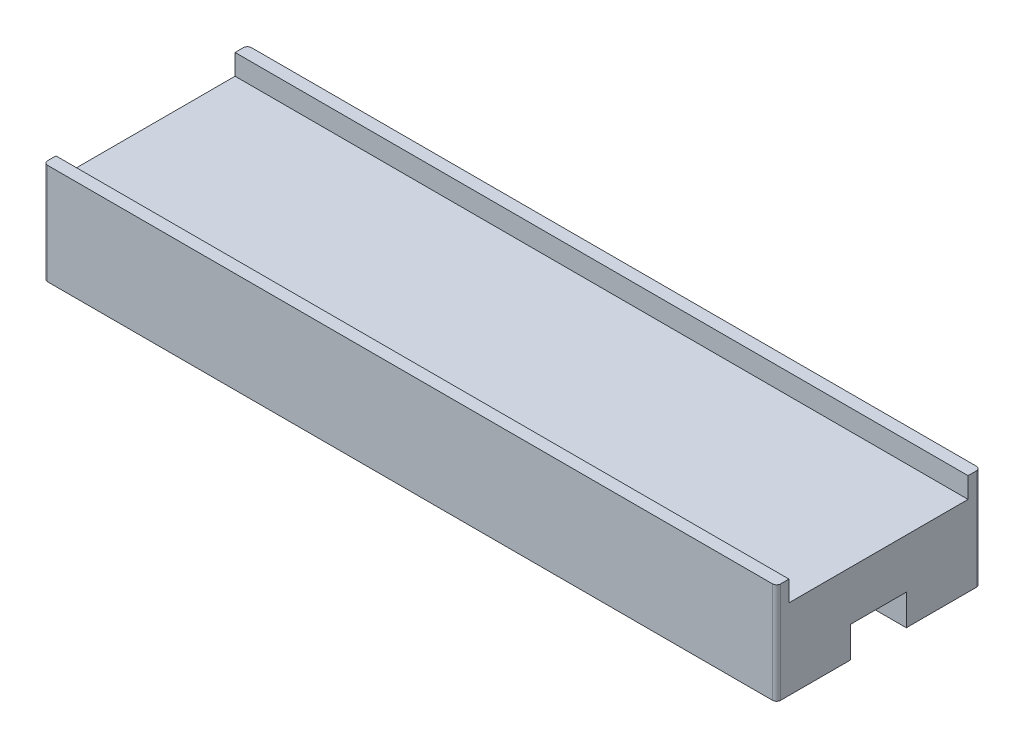
ISO-10303-21;
HEADER;
FILE_DESCRIPTION(('STEP AP214'),'2;1');
FILE_NAME('part.step','',(''),(''),'','','');
FILE_SCHEMA(('AUTOMOTIVE_DESIGN { 1 0 10303 214 1 1 1 1 }'));
ENDSEC;
DATA;
#1=APPLICATION_CONTEXT('core data for automotive mechanical design processes');
#2=APPLICATION_PROTOCOL_DEFINITION('international standard','automotive_design',2000,#1);
#3=PRODUCT_CONTEXT('',#1,'mechanical');
#4=PRODUCT('Part','Part','',(#3));
#5=PRODUCT_RELATED_PRODUCT_CATEGORY('part','',(#4));
#6=PRODUCT_DEFINITION_FORMATION('','',#4);
#7=PRODUCT_DEFINITION_CONTEXT('part definition',#1,'design');
#8=PRODUCT_DEFINITION('design','',#6,#7);
#9=PRODUCT_DEFINITION_SHAPE('','',#8);
#10=(LENGTH_UNIT() NAMED_UNIT(*) SI_UNIT(.MILLI.,.METRE.));
#11=(NAMED_UNIT(*) PLANE_ANGLE_UNIT() SI_UNIT($,.RADIAN.));
#12=(NAMED_UNIT(*) SI_UNIT($,.STERADIAN.) SOLID_ANGLE_UNIT());
#13=UNCERTAINTY_MEASURE_WITH_UNIT(LENGTH_MEASURE(1.E-05),#10,'distance_accuracy_value','');
#14=(GEOMETRIC_REPRESENTATION_CONTEXT(3) GLOBAL_UNCERTAINTY_ASSIGNED_CONTEXT((#13)) GLOBAL_UNIT_ASSIGNED_CONTEXT((#10,
#11,#12)) REPRESENTATION_CONTEXT('',''));
#15=CARTESIAN_POINT('',(0.,0.,0.));
#16=DIRECTION('',(0.,0.,1.));
#17=DIRECTION('',(1.,0.,0.));
#18=AXIS2_PLACEMENT_3D('',#15,#16,#17);
#19=CARTESIAN_POINT('',(0.,3.9,0.));
#20=DIRECTION('',(0.,-1.,0.));
#21=DIRECTION('',(0.,0.,-1.));
#22=AXIS2_PLACEMENT_3D('',#19,#20,#21);
#23=PLANE('',#22);
#24=DIRECTION('',(1.,0.,0.));
#25=VECTOR('',#24,1.);
#26=CARTESIAN_POINT('',(0.,3.9,-9.3));
#27=LINE('',#26,#25);
#28=CARTESIAN_POINT('',(0.,3.9,-9.3));
#29=VERTEX_POINT('',#28);
#30=CARTESIAN_POINT('',(35.6,3.9,-9.3));
#31=VERTEX_POINT('',#30);
#32=EDGE_CURVE('E181',#29,#31,#27,.T.);
#33=ORIENTED_EDGE('',*,*,#32,.F.);
#34=DIRECTION('',(0.,0.,1.));
#35=VECTOR('',#34,1.);
#36=CARTESIAN_POINT('',(0.,3.9,0.));
#37=LINE('',#36,#35);
#38=CARTESIAN_POINT('',(0.,3.9,-0.6));
#39=VERTEX_POINT('',#38);
#40=EDGE_CURVE('E167',#29,#39,#37,.T.);
#41=ORIENTED_EDGE('',*,*,#40,.T.);
#42=DIRECTION('',(-1.,0.,0.));
#43=VECTOR('',#42,1.);
#44=CARTESIAN_POINT('',(0.,3.9,-0.6));
#45=LINE('',#44,#43);
#46=CARTESIAN_POINT('',(35.6,3.9,-0.6));
#47=VERTEX_POINT('',#46);
#48=EDGE_CURVE('E170',#47,#39,#45,.T.);
#49=ORIENTED_EDGE('',*,*,#48,.F.);
#50=DIRECTION('',(0.,0.,-1.));
#51=VECTOR('',#50,1.);
#52=CARTESIAN_POINT('',(35.6,3.9,0.));
#53=LINE('',#52,#51);
#54=EDGE_CURVE('E202',#47,#31,#53,.T.);
#55=ORIENTED_EDGE('',*,*,#54,.T.);
#56=EDGE_LOOP('',(#33,#41,#49,#55));
#57=FACE_BOUND('',#56,.T.);
#58=ADVANCED_FACE('F34',(#57),#23,.F.);
#59=CARTESIAN_POINT('',(0.,0.,0.));
#60=DIRECTION('',(0.,-1.,0.));
#61=DIRECTION('',(0.,0.,-1.));
#62=AXIS2_PLACEMENT_3D('',#59,#60,#61);
#63=PLANE('',#62);
#64=DIRECTION('',(1.,0.,0.));
#65=VECTOR('',#64,1.);
#66=CARTESIAN_POINT('',(0.,0.,0.));
#67=LINE('',#66,#65);
#68=CARTESIAN_POINT('',(0.2,0.,0.));
#69=VERTEX_POINT('',#68);
#70=CARTESIAN_POINT('',(35.4,0.,0.));
#71=VERTEX_POINT('',#70);
#72=EDGE_CURVE('E227',#69,#71,#67,.T.);
#73=ORIENTED_EDGE('',*,*,#72,.F.);
#74=CARTESIAN_POINT('',(0.2,0.,-0.2));
#75=DIRECTION('',(0.,-1.,0.));
#76=DIRECTION('',(0.,0.,-1.));
#77=AXIS2_PLACEMENT_3D('',#74,#75,#76);
#78=CIRCLE('',#77,0.2);
#79=CARTESIAN_POINT('',(0.,0.,-0.2));
#80=VERTEX_POINT('',#79);
#81=EDGE_CURVE('E260',#69,#80,#78,.T.);
#82=ORIENTED_EDGE('',*,*,#81,.T.);
#83=DIRECTION('',(0.,0.,1.));
#84=VECTOR('',#83,1.);
#85=CARTESIAN_POINT('',(0.,0.,0.));
#86=LINE('',#85,#84);
#87=CARTESIAN_POINT('',(0.,0.,-3.6));
#88=VERTEX_POINT('',#87);
#89=EDGE_CURVE('E228',#88,#80,#86,.T.);
#90=ORIENTED_EDGE('',*,*,#89,.F.);
#91=DIRECTION('',(1.,0.,0.));
#92=VECTOR('',#91,1.);
#93=CARTESIAN_POINT('',(0.,0.,-3.6));
#94=LINE('',#93,#92);
#95=CARTESIAN_POINT('',(35.6,0.,-3.6));
#96=VERTEX_POINT('',#95);
#97=EDGE_CURVE('E221',#88,#96,#94,.T.);
#98=ORIENTED_EDGE('',*,*,#97,.T.);
#99=DIRECTION('',(0.,0.,-1.));
#100=VECTOR('',#99,1.);
#101=CARTESIAN_POINT('',(35.6,0.,0.));
#102=LINE('',#101,#100);
#103=CARTESIAN_POINT('',(35.6,0.,-0.2));
#104=VERTEX_POINT('',#103);
#105=EDGE_CURVE('E232',#104,#96,#102,.T.);
#106=ORIENTED_EDGE('',*,*,#105,.F.);
#107=CARTESIAN_POINT('',(35.4,0.,-0.2));
#108=DIRECTION('',(0.,-1.,0.));
#109=DIRECTION('',(0.,0.,-1.));
#110=AXIS2_PLACEMENT_3D('',#107,#108,#109);
#111=CIRCLE('',#110,0.2);
#112=EDGE_CURVE('E57',#104,#71,#111,.T.);
#113=ORIENTED_EDGE('',*,*,#112,.T.);
#114=EDGE_LOOP('',(#73,#82,#90,#98,#106,#113));
#115=FACE_BOUND('',#114,.T.);
#116=ADVANCED_FACE('F274',(#115),#63,.T.);
#117=CARTESIAN_POINT('',(0.,3.9,0.));
#118=DIRECTION('',(1.,0.,0.));
#119=DIRECTION('',(0.,0.,-1.));
#120=AXIS2_PLACEMENT_3D('',#117,#118,#119);
#121=PLANE('',#120);
#122=DIRECTION('',(0.,0.,1.));
#123=VECTOR('',#122,1.);
#124=CARTESIAN_POINT('',(0.,4.9,-9.9));
#125=LINE('',#124,#123);
#126=CARTESIAN_POINT('',(0.,4.9,-9.7));
#127=VERTEX_POINT('',#126);
#128=CARTESIAN_POINT('',(0.,4.9,-9.3));
#129=VERTEX_POINT('',#128);
#130=EDGE_CURVE('E147',#127,#129,#125,.T.);
#131=ORIENTED_EDGE('',*,*,#130,.F.);
#132=DIRECTION('',(0.,-1.,0.));
#133=VECTOR('',#132,1.);
#134=CARTESIAN_POINT('',(0.,3.9,-9.7));
#135=LINE('',#134,#133);
#136=CARTESIAN_POINT('',(0.,0.,-9.7));
#137=VERTEX_POINT('',#136);
#138=EDGE_CURVE('E314',#127,#137,#135,.T.);
#139=ORIENTED_EDGE('',*,*,#138,.T.);
#140=CARTESIAN_POINT('',(0.,0.,-6.3));
#141=VERTEX_POINT('',#140);
#142=EDGE_CURVE('E225',#137,#141,#86,.T.);
#143=ORIENTED_EDGE('',*,*,#142,.T.);
#144=DIRECTION('',(0.,1.,0.));
#145=VECTOR('',#144,1.);
#146=CARTESIAN_POINT('',(0.,0.,-6.3));
#147=LINE('',#146,#145);
#148=CARTESIAN_POINT('',(0.,1.5,-6.3));
#149=VERTEX_POINT('',#148);
#150=EDGE_CURVE('E284',#141,#149,#147,.T.);
#151=ORIENTED_EDGE('',*,*,#150,.T.);
#152=DIRECTION('',(0.,0.,1.));
#153=VECTOR('',#152,1.);
#154=CARTESIAN_POINT('',(0.,1.5,-3.6));
#155=LINE('',#154,#153);
#156=CARTESIAN_POINT('',(0.,1.5,-3.6));
#157=VERTEX_POINT('',#156);
#158=EDGE_CURVE('E281',#149,#157,#155,.T.);
#159=ORIENTED_EDGE('',*,*,#158,.T.);
#160=DIRECTION('',(0.,-1.,0.));
#161=VECTOR('',#160,1.);
#162=CARTESIAN_POINT('',(0.,0.,-3.6));
#163=LINE('',#162,#161);
#164=EDGE_CURVE('E196',#157,#88,#163,.T.);
#165=ORIENTED_EDGE('',*,*,#164,.T.);
#166=ORIENTED_EDGE('',*,*,#89,.T.);
#167=DIRECTION('',(0.,-1.,0.));
#168=VECTOR('',#167,1.);
#169=CARTESIAN_POINT('',(0.,3.9,-0.2));
#170=LINE('',#169,#168);
#171=CARTESIAN_POINT('',(0.,4.9,-0.2));
#172=VERTEX_POINT('',#171);
#173=EDGE_CURVE('E217',#80,#172,#170,.F.);
#174=ORIENTED_EDGE('',*,*,#173,.T.);
#175=DIRECTION('',(0.,0.,1.));
#176=VECTOR('',#175,1.);
#177=CARTESIAN_POINT('',(0.,4.9,0.));
#178=LINE('',#177,#176);
#179=CARTESIAN_POINT('',(0.,4.9,-0.6));
#180=VERTEX_POINT('',#179);
#181=EDGE_CURVE('E184',#180,#172,#178,.T.);
#182=ORIENTED_EDGE('',*,*,#181,.F.);
#183=DIRECTION('',(0.,-1.,0.));
#184=VECTOR('',#183,1.);
#185=CARTESIAN_POINT('',(0.,4.9,-0.6));
#186=LINE('',#185,#184);
#187=EDGE_CURVE('E193',#180,#39,#186,.T.);
#188=ORIENTED_EDGE('',*,*,#187,.T.);
#189=ORIENTED_EDGE('',*,*,#40,.F.);
#190=DIRECTION('',(0.,-1.,0.));
#191=VECTOR('',#190,1.);
#192=CARTESIAN_POINT('',(0.,4.9,-9.3));
#193=LINE('',#192,#191);
#194=EDGE_CURVE('E164',#129,#29,#193,.T.);
#195=ORIENTED_EDGE('',*,*,#194,.F.);
#196=EDGE_LOOP('',(#131,#139,#143,#151,#159,#165,#166,#174,#182,#188,#189,#195));
#197=FACE_BOUND('',#196,.T.);
#198=ADVANCED_FACE('F165',(#197),#121,.F.);
#199=CARTESIAN_POINT('',(0.,3.9,0.));
#200=DIRECTION('',(0.,0.,-1.));
#201=DIRECTION('',(-1.,0.,0.));
#202=AXIS2_PLACEMENT_3D('',#199,#200,#201);
#203=PLANE('',#202);
#204=DIRECTION('',(1.,0.,0.));
#205=VECTOR('',#204,1.);
#206=CARTESIAN_POINT('',(0.,4.9,0.));
#207=LINE('',#206,#205);
#208=CARTESIAN_POINT('',(0.2,4.9,0.));
#209=VERTEX_POINT('',#208);
#210=CARTESIAN_POINT('',(35.4,4.9,0.));
#211=VERTEX_POINT('',#210);
#212=EDGE_CURVE('E187',#209,#211,#207,.T.);
#213=ORIENTED_EDGE('',*,*,#212,.F.);
#214=DIRECTION('',(0.,-1.,0.));
#215=VECTOR('',#214,1.);
#216=CARTESIAN_POINT('',(0.2,3.9,0.));
#217=LINE('',#216,#215);
#218=EDGE_CURVE('E256',#209,#69,#217,.T.);
#219=ORIENTED_EDGE('',*,*,#218,.T.);
#220=ORIENTED_EDGE('',*,*,#72,.T.);
#221=DIRECTION('',(0.,-1.,0.));
#222=VECTOR('',#221,1.);
#223=CARTESIAN_POINT('',(35.4,3.9,0.));
#224=LINE('',#223,#222);
#225=EDGE_CURVE('E254',#71,#211,#224,.F.);
#226=ORIENTED_EDGE('',*,*,#225,.T.);
#227=EDGE_LOOP('',(#213,#219,#220,#226));
#228=FACE_BOUND('',#227,.T.);
#229=ADVANCED_FACE('F371',(#228),#203,.F.);
#230=CARTESIAN_POINT('',(35.6,3.9,0.));
#231=DIRECTION('',(-1.,0.,0.));
#232=DIRECTION('',(0.,0.,1.));
#233=AXIS2_PLACEMENT_3D('',#230,#231,#232);
#234=PLANE('',#233);
#235=CARTESIAN_POINT('',(35.6,0.,-6.3));
#236=VERTEX_POINT('',#235);
#237=CARTESIAN_POINT('',(35.6,0.,-9.7));
#238=VERTEX_POINT('',#237);
#239=EDGE_CURVE('E231',#236,#238,#102,.T.);
#240=ORIENTED_EDGE('',*,*,#239,.T.);
#241=DIRECTION('',(0.,-1.,0.));
#242=VECTOR('',#241,1.);
#243=CARTESIAN_POINT('',(35.6,3.9,-9.7));
#244=LINE('',#243,#242);
#245=CARTESIAN_POINT('',(35.6,4.9,-9.7));
#246=VERTEX_POINT('',#245);
#247=EDGE_CURVE('E11',#238,#246,#244,.F.);
#248=ORIENTED_EDGE('',*,*,#247,.T.);
#249=DIRECTION('',(0.,0.,-1.));
#250=VECTOR('',#249,1.);
#251=CARTESIAN_POINT('',(35.6,4.9,-9.9));
#252=LINE('',#251,#250);
#253=CARTESIAN_POINT('',(35.6,4.9,-9.30000000000001));
#254=VERTEX_POINT('',#253);
#255=EDGE_CURVE('E176',#254,#246,#252,.T.);
#256=ORIENTED_EDGE('',*,*,#255,.F.);
#257=DIRECTION('',(0.,-1.,0.));
#258=VECTOR('',#257,1.);
#259=CARTESIAN_POINT('',(35.6,4.9,-9.30000000000001));
#260=LINE('',#259,#258);
#261=EDGE_CURVE('E171',#254,#31,#260,.T.);
#262=ORIENTED_EDGE('',*,*,#261,.T.);
#263=ORIENTED_EDGE('',*,*,#54,.F.);
#264=DIRECTION('',(0.,-1.,0.));
#265=VECTOR('',#264,1.);
#266=CARTESIAN_POINT('',(35.6,4.9,-0.6));
#267=LINE('',#266,#265);
#268=CARTESIAN_POINT('',(35.6,4.9,-0.6));
#269=VERTEX_POINT('',#268);
#270=EDGE_CURVE('E206',#269,#47,#267,.T.);
#271=ORIENTED_EDGE('',*,*,#270,.F.);
#272=DIRECTION('',(0.,0.,-1.));
#273=VECTOR('',#272,1.);
#274=CARTESIAN_POINT('',(35.6,4.9,0.));
#275=LINE('',#274,#273);
#276=CARTESIAN_POINT('',(35.6,4.9,-0.2));
#277=VERTEX_POINT('',#276);
#278=EDGE_CURVE('E189',#277,#269,#275,.T.);
#279=ORIENTED_EDGE('',*,*,#278,.F.);
#280=DIRECTION('',(0.,-1.,0.));
#281=VECTOR('',#280,1.);
#282=CARTESIAN_POINT('',(35.6,3.9,-0.2));
#283=LINE('',#282,#281);
#284=EDGE_CURVE('E42',#277,#104,#283,.T.);
#285=ORIENTED_EDGE('',*,*,#284,.T.);
#286=ORIENTED_EDGE('',*,*,#105,.T.);
#287=DIRECTION('',(0.,-1.,0.));
#288=VECTOR('',#287,1.);
#289=CARTESIAN_POINT('',(35.6,0.,-3.6));
#290=LINE('',#289,#288);
#291=CARTESIAN_POINT('',(35.6,1.5,-3.6));
#292=VERTEX_POINT('',#291);
#293=EDGE_CURVE('E211',#292,#96,#290,.T.);
#294=ORIENTED_EDGE('',*,*,#293,.F.);
#295=DIRECTION('',(0.,0.,1.));
#296=VECTOR('',#295,1.);
#297=CARTESIAN_POINT('',(35.6,1.5,-3.6));
#298=LINE('',#297,#296);
#299=CARTESIAN_POINT('',(35.6,1.5,-6.3));
#300=VERTEX_POINT('',#299);
#301=EDGE_CURVE('E293',#300,#292,#298,.T.);
#302=ORIENTED_EDGE('',*,*,#301,.F.);
#303=DIRECTION('',(0.,1.,0.));
#304=VECTOR('',#303,1.);
#305=CARTESIAN_POINT('',(35.6,0.,-6.3));
#306=LINE('',#305,#304);
#307=EDGE_CURVE('E290',#236,#300,#306,.T.);
#308=ORIENTED_EDGE('',*,*,#307,.F.);
#309=EDGE_LOOP('',(#240,#248,#256,#262,#263,#271,#279,#285,#286,#294,#302,#308));
#310=FACE_BOUND('',#309,.T.);
#311=ADVANCED_FACE('F267',(#310),#234,.F.);
#312=CARTESIAN_POINT('',(0.,3.9,-9.9));
#313=DIRECTION('',(0.,0.,1.));
#314=DIRECTION('',(1.,0.,0.));
#315=AXIS2_PLACEMENT_3D('',#312,#313,#314);
#316=PLANE('',#315);
#317=DIRECTION('',(-1.,0.,0.));
#318=VECTOR('',#317,1.);
#319=CARTESIAN_POINT('',(0.,0.,-9.9));
#320=LINE('',#319,#318);
#321=CARTESIAN_POINT('',(35.4,0.,-9.9));
#322=VERTEX_POINT('',#321);
#323=CARTESIAN_POINT('',(0.2,0.,-9.9));
#324=VERTEX_POINT('',#323);
#325=EDGE_CURVE('E216',#322,#324,#320,.T.);
#326=ORIENTED_EDGE('',*,*,#325,.T.);
#327=DIRECTION('',(0.,-1.,0.));
#328=VECTOR('',#327,1.);
#329=CARTESIAN_POINT('',(0.2,3.9,-9.9));
#330=LINE('',#329,#328);
#331=CARTESIAN_POINT('',(0.2,4.9,-9.9));
#332=VERTEX_POINT('',#331);
#333=EDGE_CURVE('E240',#324,#332,#330,.F.);
#334=ORIENTED_EDGE('',*,*,#333,.T.);
#335=DIRECTION('',(-1.,0.,0.));
#336=VECTOR('',#335,1.);
#337=CARTESIAN_POINT('',(0.,4.9,-9.9));
#338=LINE('',#337,#336);
#339=CARTESIAN_POINT('',(35.4,4.9,-9.9));
#340=VERTEX_POINT('',#339);
#341=EDGE_CURVE('E160',#340,#332,#338,.T.);
#342=ORIENTED_EDGE('',*,*,#341,.F.);
#343=DIRECTION('',(0.,-1.,0.));
#344=VECTOR('',#343,1.);
#345=CARTESIAN_POINT('',(35.4,3.9,-9.9));
#346=LINE('',#345,#344);
#347=EDGE_CURVE('E242',#340,#322,#346,.T.);
#348=ORIENTED_EDGE('',*,*,#347,.T.);
#349=EDGE_LOOP('',(#326,#334,#342,#348));
#350=FACE_BOUND('',#349,.T.);
#351=ADVANCED_FACE('F238',(#350),#316,.F.);
#352=ORIENTED_EDGE('',*,*,#142,.F.);
#353=CARTESIAN_POINT('',(0.2,0.,-9.7));
#354=DIRECTION('',(0.,-1.,0.));
#355=DIRECTION('',(0.,0.,-1.));
#356=AXIS2_PLACEMENT_3D('',#353,#354,#355);
#357=CIRCLE('',#356,0.2);
#358=EDGE_CURVE('E246',#137,#324,#357,.T.);
#359=ORIENTED_EDGE('',*,*,#358,.T.);
#360=ORIENTED_EDGE('',*,*,#325,.F.);
#361=CARTESIAN_POINT('',(35.4,0.,-9.7));
#362=DIRECTION('',(0.,-1.,0.));
#363=DIRECTION('',(0.,0.,-1.));
#364=AXIS2_PLACEMENT_3D('',#361,#362,#363);
#365=CIRCLE('',#364,0.2);
#366=EDGE_CURVE('E315',#322,#238,#365,.T.);
#367=ORIENTED_EDGE('',*,*,#366,.T.);
#368=ORIENTED_EDGE('',*,*,#239,.F.);
#369=DIRECTION('',(1.,0.,0.));
#370=VECTOR('',#369,1.);
#371=CARTESIAN_POINT('',(0.,0.,-6.3));
#372=LINE('',#371,#370);
#373=EDGE_CURVE('E280',#141,#236,#372,.T.);
#374=ORIENTED_EDGE('',*,*,#373,.F.);
#375=EDGE_LOOP('',(#352,#359,#360,#367,#368,#374));
#376=FACE_BOUND('',#375,.T.);
#377=ADVANCED_FACE('F324',(#376),#63,.T.);
#378=CARTESIAN_POINT('',(0.,0.,-3.6));
#379=DIRECTION('',(0.,0.,1.));
#380=DIRECTION('',(0.,-1.,0.));
#381=AXIS2_PLACEMENT_3D('',#378,#379,#380);
#382=PLANE('',#381);
#383=ORIENTED_EDGE('',*,*,#293,.T.);
#384=ORIENTED_EDGE('',*,*,#97,.F.);
#385=ORIENTED_EDGE('',*,*,#164,.F.);
#386=DIRECTION('',(1.,0.,0.));
#387=VECTOR('',#386,1.);
#388=CARTESIAN_POINT('',(0.,1.5,-3.6));
#389=LINE('',#388,#387);
#390=EDGE_CURVE('E296',#157,#292,#389,.T.);
#391=ORIENTED_EDGE('',*,*,#390,.T.);
#392=EDGE_LOOP('',(#383,#384,#385,#391));
#393=FACE_BOUND('',#392,.T.);
#394=ADVANCED_FACE('F307',(#393),#382,.F.);
#395=CARTESIAN_POINT('',(0.,1.5,-3.6));
#396=DIRECTION('',(0.,1.,0.));
#397=DIRECTION('',(0.,0.,1.));
#398=AXIS2_PLACEMENT_3D('',#395,#396,#397);
#399=PLANE('',#398);
#400=ORIENTED_EDGE('',*,*,#301,.T.);
#401=ORIENTED_EDGE('',*,*,#390,.F.);
#402=ORIENTED_EDGE('',*,*,#158,.F.);
#403=DIRECTION('',(1.,0.,0.));
#404=VECTOR('',#403,1.);
#405=CARTESIAN_POINT('',(0.,1.5,-6.3));
#406=LINE('',#405,#404);
#407=EDGE_CURVE('E282',#149,#300,#406,.T.);
#408=ORIENTED_EDGE('',*,*,#407,.T.);
#409=EDGE_LOOP('',(#400,#401,#402,#408));
#410=FACE_BOUND('',#409,.T.);
#411=ADVANCED_FACE('F299',(#410),#399,.F.);
#412=CARTESIAN_POINT('',(0.,0.,-6.3));
#413=DIRECTION('',(0.,0.,-1.));
#414=DIRECTION('',(-1.,0.,0.));
#415=AXIS2_PLACEMENT_3D('',#412,#413,#414);
#416=PLANE('',#415);
#417=ORIENTED_EDGE('',*,*,#307,.T.);
#418=ORIENTED_EDGE('',*,*,#407,.F.);
#419=ORIENTED_EDGE('',*,*,#150,.F.);
#420=ORIENTED_EDGE('',*,*,#373,.T.);
#421=EDGE_LOOP('',(#417,#418,#419,#420));
#422=FACE_BOUND('',#421,.T.);
#423=ADVANCED_FACE('F304',(#422),#416,.F.);
#424=CARTESIAN_POINT('',(0.,4.9,-0.6));
#425=DIRECTION('',(0.,0.,1.));
#426=DIRECTION('',(1.,0.,0.));
#427=AXIS2_PLACEMENT_3D('',#424,#425,#426);
#428=PLANE('',#427);
#429=ORIENTED_EDGE('',*,*,#48,.T.);
#430=ORIENTED_EDGE('',*,*,#187,.F.);
#431=DIRECTION('',(-1.,0.,0.));
#432=VECTOR('',#431,1.);
#433=CARTESIAN_POINT('',(0.,4.9,-0.6));
#434=LINE('',#433,#432);
#435=EDGE_CURVE('E191',#269,#180,#434,.T.);
#436=ORIENTED_EDGE('',*,*,#435,.F.);
#437=ORIENTED_EDGE('',*,*,#270,.T.);
#438=EDGE_LOOP('',(#429,#430,#436,#437));
#439=FACE_BOUND('',#438,.T.);
#440=ADVANCED_FACE('F341',(#439),#428,.F.);
#441=CARTESIAN_POINT('',(0.,4.9,0.));
#442=DIRECTION('',(0.,-1.,0.));
#443=DIRECTION('',(0.,0.,-1.));
#444=AXIS2_PLACEMENT_3D('',#441,#442,#443);
#445=PLANE('',#444);
#446=ORIENTED_EDGE('',*,*,#181,.T.);
#447=CARTESIAN_POINT('',(0.2,4.9,-0.2));
#448=DIRECTION('',(0.,-1.,0.));
#449=DIRECTION('',(0.,0.,-1.));
#450=AXIS2_PLACEMENT_3D('',#447,#448,#449);
#451=CIRCLE('',#450,0.2);
#452=EDGE_CURVE('E263',#172,#209,#451,.F.);
#453=ORIENTED_EDGE('',*,*,#452,.T.);
#454=ORIENTED_EDGE('',*,*,#212,.T.);
#455=CARTESIAN_POINT('',(35.4,4.9,-0.2));
#456=DIRECTION('',(0.,-1.,0.));
#457=DIRECTION('',(0.,0.,-1.));
#458=AXIS2_PLACEMENT_3D('',#455,#456,#457);
#459=CIRCLE('',#458,0.2);
#460=EDGE_CURVE('E49',#211,#277,#459,.F.);
#461=ORIENTED_EDGE('',*,*,#460,.T.);
#462=ORIENTED_EDGE('',*,*,#278,.T.);
#463=ORIENTED_EDGE('',*,*,#435,.T.);
#464=EDGE_LOOP('',(#446,#453,#454,#461,#462,#463));
#465=FACE_BOUND('',#464,.T.);
#466=ADVANCED_FACE('F346',(#465),#445,.F.);
#467=CARTESIAN_POINT('',(0.,4.9,-9.3));
#468=DIRECTION('',(0.,0.,-1.));
#469=DIRECTION('',(-1.,0.,0.));
#470=AXIS2_PLACEMENT_3D('',#467,#468,#469);
#471=PLANE('',#470);
#472=ORIENTED_EDGE('',*,*,#32,.T.);
#473=ORIENTED_EDGE('',*,*,#261,.F.);
#474=DIRECTION('',(1.,0.,0.));
#475=VECTOR('',#474,1.);
#476=CARTESIAN_POINT('',(0.,4.9,-9.3));
#477=LINE('',#476,#475);
#478=EDGE_CURVE('E153',#129,#254,#477,.T.);
#479=ORIENTED_EDGE('',*,*,#478,.F.);
#480=ORIENTED_EDGE('',*,*,#194,.T.);
#481=EDGE_LOOP('',(#472,#473,#479,#480));
#482=FACE_BOUND('',#481,.T.);
#483=ADVANCED_FACE('F173',(#482),#471,.F.);
#484=CARTESIAN_POINT('',(0.,4.9,0.));
#485=DIRECTION('',(0.,-1.,0.));
#486=DIRECTION('',(0.,0.,-1.));
#487=AXIS2_PLACEMENT_3D('',#484,#485,#486);
#488=PLANE('',#487);
#489=ORIENTED_EDGE('',*,*,#341,.T.);
#490=CARTESIAN_POINT('',(0.2,4.9,-9.7));
#491=DIRECTION('',(0.,-1.,0.));
#492=DIRECTION('',(0.,0.,-1.));
#493=AXIS2_PLACEMENT_3D('',#490,#491,#492);
#494=CIRCLE('',#493,0.2);
#495=EDGE_CURVE('E156',#332,#127,#494,.F.);
#496=ORIENTED_EDGE('',*,*,#495,.T.);
#497=ORIENTED_EDGE('',*,*,#130,.T.);
#498=ORIENTED_EDGE('',*,*,#478,.T.);
#499=ORIENTED_EDGE('',*,*,#255,.T.);
#500=CARTESIAN_POINT('',(35.4,4.9,-9.7));
#501=DIRECTION('',(0.,-1.,0.));
#502=DIRECTION('',(0.,0.,-1.));
#503=AXIS2_PLACEMENT_3D('',#500,#501,#502);
#504=CIRCLE('',#503,0.2);
#505=EDGE_CURVE('E247',#246,#340,#504,.F.);
#506=ORIENTED_EDGE('',*,*,#505,.T.);
#507=EDGE_LOOP('',(#489,#496,#497,#498,#499,#506));
#508=FACE_BOUND('',#507,.T.);
#509=ADVANCED_FACE('F150',(#508),#488,.F.);
#510=CARTESIAN_POINT('',(0.2,3.9,-9.7));
#511=DIRECTION('',(0.,-1.,0.));
#512=DIRECTION('',(0.,0.,-1.));
#513=AXIS2_PLACEMENT_3D('',#510,#511,#512);
#514=CYLINDRICAL_SURFACE('',#513,0.2);
#515=ORIENTED_EDGE('',*,*,#495,.F.);
#516=ORIENTED_EDGE('',*,*,#333,.F.);
#517=ORIENTED_EDGE('',*,*,#358,.F.);
#518=ORIENTED_EDGE('',*,*,#138,.F.);
#519=EDGE_LOOP('',(#515,#516,#517,#518));
#520=FACE_BOUND('',#519,.T.);
#521=ADVANCED_FACE('F245',(#520),#514,.T.);
#522=CARTESIAN_POINT('',(0.2,3.9,-0.2));
#523=DIRECTION('',(0.,-1.,0.));
#524=DIRECTION('',(0.,0.,-1.));
#525=AXIS2_PLACEMENT_3D('',#522,#523,#524);
#526=CYLINDRICAL_SURFACE('',#525,0.2);
#527=ORIENTED_EDGE('',*,*,#452,.F.);
#528=ORIENTED_EDGE('',*,*,#173,.F.);
#529=ORIENTED_EDGE('',*,*,#81,.F.);
#530=ORIENTED_EDGE('',*,*,#218,.F.);
#531=EDGE_LOOP('',(#527,#528,#529,#530));
#532=FACE_BOUND('',#531,.T.);
#533=ADVANCED_FACE('F312',(#532),#526,.T.);
#534=CARTESIAN_POINT('',(35.4,3.9,-9.7));
#535=DIRECTION('',(0.,-1.,0.));
#536=DIRECTION('',(0.,0.,-1.));
#537=AXIS2_PLACEMENT_3D('',#534,#535,#536);
#538=CYLINDRICAL_SURFACE('',#537,0.2);
#539=ORIENTED_EDGE('',*,*,#505,.F.);
#540=ORIENTED_EDGE('',*,*,#247,.F.);
#541=ORIENTED_EDGE('',*,*,#366,.F.);
#542=ORIENTED_EDGE('',*,*,#347,.F.);
#543=EDGE_LOOP('',(#539,#540,#541,#542));
#544=FACE_BOUND('',#543,.T.);
#545=ADVANCED_FACE('F321',(#544),#538,.T.);
#546=CARTESIAN_POINT('',(35.4,3.9,-0.2));
#547=DIRECTION('',(0.,-1.,0.));
#548=DIRECTION('',(0.,0.,-1.));
#549=AXIS2_PLACEMENT_3D('',#546,#547,#548);
#550=CYLINDRICAL_SURFACE('',#549,0.2);
#551=ORIENTED_EDGE('',*,*,#460,.F.);
#552=ORIENTED_EDGE('',*,*,#225,.F.);
#553=ORIENTED_EDGE('',*,*,#112,.F.);
#554=ORIENTED_EDGE('',*,*,#284,.F.);
#555=EDGE_LOOP('',(#551,#552,#553,#554));
#556=FACE_BOUND('',#555,.T.);
#557=ADVANCED_FACE('F36',(#556),#550,.T.);
#558=CLOSED_SHELL('',(#58,#116,#198,#229,#311,#351,#377,#394,#411,#423,#440,#466,#483,#509,#521,
#533,#545,#557));
#559=MANIFOLD_SOLID_BREP('B2',#558);
#560=ADVANCED_BREP_SHAPE_REPRESENTATION('',(#18,#559),#14);
#561=SHAPE_DEFINITION_REPRESENTATION(#9,#560);
ENDSEC;
END-ISO-10303-21;
